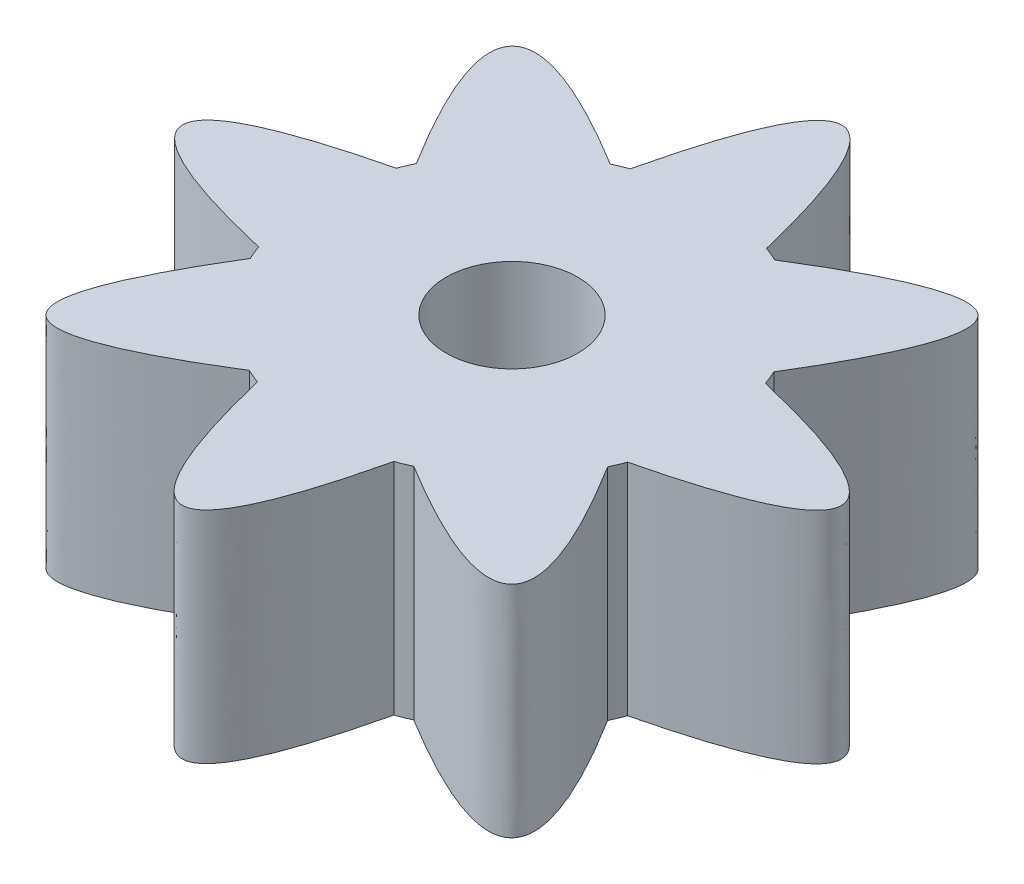
ISO-10303-21;
HEADER;
FILE_DESCRIPTION(('STEP AP214'),'2;1');
FILE_NAME('part.step','',(''),(''),'','','');
FILE_SCHEMA(('AUTOMOTIVE_DESIGN { 1 0 10303 214 1 1 1 1 }'));
ENDSEC;
DATA;
#1=APPLICATION_CONTEXT('core data for automotive mechanical design processes');
#2=APPLICATION_PROTOCOL_DEFINITION('international standard','automotive_design',2000,#1);
#3=PRODUCT_CONTEXT('',#1,'mechanical');
#4=PRODUCT('Part','Part','',(#3));
#5=PRODUCT_RELATED_PRODUCT_CATEGORY('part','',(#4));
#6=PRODUCT_DEFINITION_FORMATION('','',#4);
#7=PRODUCT_DEFINITION_CONTEXT('part definition',#1,'design');
#8=PRODUCT_DEFINITION('design','',#6,#7);
#9=PRODUCT_DEFINITION_SHAPE('','',#8);
#10=(LENGTH_UNIT() NAMED_UNIT(*) SI_UNIT(.MILLI.,.METRE.));
#11=(NAMED_UNIT(*) PLANE_ANGLE_UNIT() SI_UNIT($,.RADIAN.));
#12=(NAMED_UNIT(*) SI_UNIT($,.STERADIAN.) SOLID_ANGLE_UNIT());
#13=UNCERTAINTY_MEASURE_WITH_UNIT(LENGTH_MEASURE(1.E-05),#10,'distance_accuracy_value','');
#14=(GEOMETRIC_REPRESENTATION_CONTEXT(3) GLOBAL_UNCERTAINTY_ASSIGNED_CONTEXT((#13)) GLOBAL_UNIT_ASSIGNED_CONTEXT((#10,
#11,#12)) REPRESENTATION_CONTEXT('',''));
#15=CARTESIAN_POINT('',(0.,0.,0.));
#16=DIRECTION('',(0.,0.,1.));
#17=DIRECTION('',(1.,0.,0.));
#18=AXIS2_PLACEMENT_3D('',#15,#16,#17);
#19=CARTESIAN_POINT('',(-6.,2.5,42.5));
#20=DIRECTION('',(0.,-1.,0.));
#21=DIRECTION('',(0.,0.,-1.));
#22=AXIS2_PLACEMENT_3D('',#19,#20,#21);
#23=CYLINDRICAL_SURFACE('',#22,4.5);
#24=CARTESIAN_POINT('',(-6.,2.5,42.5));
#25=DIRECTION('',(0.,1.,0.));
#26=DIRECTION('',(0.,0.,1.));
#27=AXIS2_PLACEMENT_3D('',#24,#25,#26);
#28=CIRCLE('',#27,4.5);
#29=CARTESIAN_POINT('',(-7.90144374892193,2.5,46.5785428365638));
#30=VERTEX_POINT('',#29);
#31=CARTESIAN_POINT('',(-7.58091960966795,2.5,46.7131571520378));
#32=VERTEX_POINT('',#31);
#33=EDGE_CURVE('E45',#30,#32,#28,.T.);
#34=ORIENTED_EDGE('',*,*,#33,.F.);
#35=DIRECTION('',(0.,-1.,0.));
#36=VECTOR('',#35,1.);
#37=CARTESIAN_POINT('',(-7.90144374892191,2.5,46.5785428365638));
#38=LINE('',#37,#36);
#39=CARTESIAN_POINT('',(-7.90144374892191,-2.5,46.5785428365638));
#40=VERTEX_POINT('',#39);
#41=EDGE_CURVE('E159',#30,#40,#38,.T.);
#42=ORIENTED_EDGE('',*,*,#41,.T.);
#43=CARTESIAN_POINT('',(-6.,-2.5,42.5));
#44=DIRECTION('',(0.,1.,0.));
#45=DIRECTION('',(0.,0.,1.));
#46=AXIS2_PLACEMENT_3D('',#43,#44,#45);
#47=CIRCLE('',#46,4.5);
#48=CARTESIAN_POINT('',(-7.58091960966795,-2.5,46.7131571520378));
#49=VERTEX_POINT('',#48);
#50=EDGE_CURVE('E150',#40,#49,#47,.T.);
#51=ORIENTED_EDGE('',*,*,#50,.T.);
#52=DIRECTION('',(0.,-1.,0.));
#53=VECTOR('',#52,1.);
#54=CARTESIAN_POINT('',(-7.58091960966793,2.5,46.7131571520378));
#55=LINE('',#54,#53);
#56=EDGE_CURVE('E338',#32,#49,#55,.T.);
#57=ORIENTED_EDGE('',*,*,#56,.F.);
#58=EDGE_LOOP('',(#34,#42,#51,#57));
#59=FACE_BOUND('',#58,.T.);
#60=ADVANCED_FACE('F35',(#59),#23,.T.);
#61=CARTESIAN_POINT('',(-10.2284890660015,-2.5,44.0394415281866));
#62=VERTEX_POINT('',#61);
#63=CARTESIAN_POINT('',(-10.0970309689175,-2.5,44.3612730159036));
#64=VERTEX_POINT('',#63);
#65=EDGE_CURVE('E157',#62,#64,#47,.T.);
#66=ORIENTED_EDGE('',*,*,#65,.T.);
#67=DIRECTION('',(0.,-1.,0.));
#68=VECTOR('',#67,1.);
#69=CARTESIAN_POINT('',(-10.0970309689175,2.5,44.3612730159036));
#70=LINE('',#69,#68);
#71=CARTESIAN_POINT('',(-10.0970309689175,2.5,44.3612730159036));
#72=VERTEX_POINT('',#71);
#73=EDGE_CURVE('E59',#72,#64,#70,.T.);
#74=ORIENTED_EDGE('',*,*,#73,.F.);
#75=CARTESIAN_POINT('',(-10.2284890660015,2.5,44.0394415281866));
#76=VERTEX_POINT('',#75);
#77=EDGE_CURVE('E385',#76,#72,#28,.T.);
#78=ORIENTED_EDGE('',*,*,#77,.F.);
#79=DIRECTION('',(0.,-1.,0.));
#80=VECTOR('',#79,1.);
#81=CARTESIAN_POINT('',(-10.2284890660015,2.5,44.0394415281866));
#82=LINE('',#81,#80);
#83=EDGE_CURVE('E228',#76,#62,#82,.T.);
#84=ORIENTED_EDGE('',*,*,#83,.T.);
#85=EDGE_LOOP('',(#66,#74,#78,#84));
#86=FACE_BOUND('',#85,.T.);
#87=ADVANCED_FACE('F358',(#86),#23,.T.);
#88=CARTESIAN_POINT('',(-10.0785428365638,-2.5,40.5985562510781));
#89=VERTEX_POINT('',#88);
#90=CARTESIAN_POINT('',(-10.2131571520378,-2.5,40.9190803903321));
#91=VERTEX_POINT('',#90);
#92=EDGE_CURVE('E414',#89,#91,#47,.T.);
#93=ORIENTED_EDGE('',*,*,#92,.T.);
#94=DIRECTION('',(0.,-1.,0.));
#95=VECTOR('',#94,1.);
#96=CARTESIAN_POINT('',(-10.2131571520378,2.5,40.9190803903321));
#97=LINE('',#96,#95);
#98=CARTESIAN_POINT('',(-10.2131571520378,2.5,40.9190803903321));
#99=VERTEX_POINT('',#98);
#100=EDGE_CURVE('E190',#99,#91,#97,.T.);
#101=ORIENTED_EDGE('',*,*,#100,.F.);
#102=CARTESIAN_POINT('',(-10.0785428365638,2.5,40.5985562510781));
#103=VERTEX_POINT('',#102);
#104=EDGE_CURVE('E386',#103,#99,#28,.T.);
#105=ORIENTED_EDGE('',*,*,#104,.F.);
#106=DIRECTION('',(0.,-1.,0.));
#107=VECTOR('',#106,1.);
#108=CARTESIAN_POINT('',(-10.0785428365638,2.5,40.5985562510781));
#109=LINE('',#108,#107);
#110=EDGE_CURVE('E229',#103,#89,#109,.T.);
#111=ORIENTED_EDGE('',*,*,#110,.T.);
#112=EDGE_LOOP('',(#93,#101,#105,#111));
#113=FACE_BOUND('',#112,.T.);
#114=ADVANCED_FACE('F362',(#113),#23,.T.);
#115=CARTESIAN_POINT('',(-7.53944152818656,-2.5,38.2715109339985));
#116=VERTEX_POINT('',#115);
#117=CARTESIAN_POINT('',(-7.86127301590357,-2.5,38.4029690310825));
#118=VERTEX_POINT('',#117);
#119=EDGE_CURVE('E411',#116,#118,#47,.T.);
#120=ORIENTED_EDGE('',*,*,#119,.T.);
#121=DIRECTION('',(0.,-1.,0.));
#122=VECTOR('',#121,1.);
#123=CARTESIAN_POINT('',(-7.86127301590359,2.5,38.4029690310825));
#124=LINE('',#123,#122);
#125=CARTESIAN_POINT('',(-7.86127301590357,2.5,38.4029690310825));
#126=VERTEX_POINT('',#125);
#127=EDGE_CURVE('E219',#126,#118,#124,.T.);
#128=ORIENTED_EDGE('',*,*,#127,.F.);
#129=CARTESIAN_POINT('',(-7.53944152818656,2.5,38.2715109339985));
#130=VERTEX_POINT('',#129);
#131=EDGE_CURVE('E389',#130,#126,#28,.T.);
#132=ORIENTED_EDGE('',*,*,#131,.F.);
#133=DIRECTION('',(0.,-1.,0.));
#134=VECTOR('',#133,1.);
#135=CARTESIAN_POINT('',(-7.53944152818656,2.5,38.2715109339985));
#136=LINE('',#135,#134);
#137=EDGE_CURVE('E251',#130,#116,#136,.T.);
#138=ORIENTED_EDGE('',*,*,#137,.T.);
#139=EDGE_LOOP('',(#120,#128,#132,#138));
#140=FACE_BOUND('',#139,.T.);
#141=ADVANCED_FACE('F415',(#140),#23,.T.);
#142=CARTESIAN_POINT('',(-4.09855625107805,-2.5,38.4214571634362));
#143=VERTEX_POINT('',#142);
#144=CARTESIAN_POINT('',(-4.41908039033205,-2.5,38.2868428479622));
#145=VERTEX_POINT('',#144);
#146=EDGE_CURVE('E407',#143,#145,#47,.T.);
#147=ORIENTED_EDGE('',*,*,#146,.T.);
#148=DIRECTION('',(0.,-1.,0.));
#149=VECTOR('',#148,1.);
#150=CARTESIAN_POINT('',(-4.41908039033207,2.5,38.2868428479622));
#151=LINE('',#150,#149);
#152=CARTESIAN_POINT('',(-4.41908039033205,2.5,38.2868428479622));
#153=VERTEX_POINT('',#152);
#154=EDGE_CURVE('E243',#153,#145,#151,.T.);
#155=ORIENTED_EDGE('',*,*,#154,.F.);
#156=CARTESIAN_POINT('',(-4.09855625107803,2.5,38.4214571634362));
#157=VERTEX_POINT('',#156);
#158=EDGE_CURVE('E392',#157,#153,#28,.T.);
#159=ORIENTED_EDGE('',*,*,#158,.F.);
#160=DIRECTION('',(0.,-1.,0.));
#161=VECTOR('',#160,1.);
#162=CARTESIAN_POINT('',(-4.09855625107805,2.5,38.4214571634362));
#163=LINE('',#162,#161);
#164=EDGE_CURVE('E301',#157,#143,#163,.T.);
#165=ORIENTED_EDGE('',*,*,#164,.T.);
#166=EDGE_LOOP('',(#147,#155,#159,#165));
#167=FACE_BOUND('',#166,.T.);
#168=ADVANCED_FACE('F406',(#167),#23,.T.);
#169=CARTESIAN_POINT('',(-1.77151093399846,-2.5,40.9605584718134));
#170=VERTEX_POINT('',#169);
#171=CARTESIAN_POINT('',(-1.90296903108249,-2.5,40.6387269840964));
#172=VERTEX_POINT('',#171);
#173=EDGE_CURVE('E379',#170,#172,#47,.T.);
#174=ORIENTED_EDGE('',*,*,#173,.T.);
#175=DIRECTION('',(0.,-1.,0.));
#176=VECTOR('',#175,1.);
#177=CARTESIAN_POINT('',(-1.90296903108248,2.5,40.6387269840964));
#178=LINE('',#177,#176);
#179=CARTESIAN_POINT('',(-1.90296903108249,2.5,40.6387269840964));
#180=VERTEX_POINT('',#179);
#181=EDGE_CURVE('E266',#180,#172,#178,.T.);
#182=ORIENTED_EDGE('',*,*,#181,.F.);
#183=CARTESIAN_POINT('',(-1.77151093399846,2.5,40.9605584718134));
#184=VERTEX_POINT('',#183);
#185=EDGE_CURVE('E395',#184,#180,#28,.T.);
#186=ORIENTED_EDGE('',*,*,#185,.F.);
#187=DIRECTION('',(0.,-1.,0.));
#188=VECTOR('',#187,1.);
#189=CARTESIAN_POINT('',(-1.77151093399846,2.5,40.9605584718134));
#190=LINE('',#189,#188);
#191=EDGE_CURVE('E302',#184,#170,#190,.T.);
#192=ORIENTED_EDGE('',*,*,#191,.T.);
#193=EDGE_LOOP('',(#174,#182,#186,#192));
#194=FACE_BOUND('',#193,.T.);
#195=ADVANCED_FACE('F369',(#194),#23,.T.);
#196=CARTESIAN_POINT('',(-1.92145716343623,-2.5,44.401443748922));
#197=VERTEX_POINT('',#196);
#198=CARTESIAN_POINT('',(-1.78684284796218,-2.5,44.0809196096679));
#199=VERTEX_POINT('',#198);
#200=EDGE_CURVE('E373',#197,#199,#47,.T.);
#201=ORIENTED_EDGE('',*,*,#200,.T.);
#202=DIRECTION('',(0.,-1.,0.));
#203=VECTOR('',#202,1.);
#204=CARTESIAN_POINT('',(-1.78684284796218,2.5,44.0809196096679));
#205=LINE('',#204,#203);
#206=CARTESIAN_POINT('',(-1.78684284796218,2.5,44.0809196096679));
#207=VERTEX_POINT('',#206);
#208=EDGE_CURVE('E292',#207,#199,#205,.T.);
#209=ORIENTED_EDGE('',*,*,#208,.F.);
#210=CARTESIAN_POINT('',(-1.92145716343624,2.5,44.401443748922));
#211=VERTEX_POINT('',#210);
#212=EDGE_CURVE('E44',#211,#207,#28,.T.);
#213=ORIENTED_EDGE('',*,*,#212,.F.);
#214=DIRECTION('',(0.,-1.,0.));
#215=VECTOR('',#214,1.);
#216=CARTESIAN_POINT('',(-1.92145716343623,2.5,44.401443748922));
#217=LINE('',#216,#215);
#218=EDGE_CURVE('E324',#211,#197,#217,.T.);
#219=ORIENTED_EDGE('',*,*,#218,.T.);
#220=EDGE_LOOP('',(#201,#209,#213,#219));
#221=FACE_BOUND('',#220,.T.);
#222=ADVANCED_FACE('F364',(#221),#23,.T.);
#223=CARTESIAN_POINT('',(-4.46055847181344,-2.5,46.7284890660016));
#224=VERTEX_POINT('',#223);
#225=CARTESIAN_POINT('',(-4.13872698409646,-2.5,46.5970309689175));
#226=VERTEX_POINT('',#225);
#227=EDGE_CURVE('E39',#224,#226,#47,.T.);
#228=ORIENTED_EDGE('',*,*,#227,.T.);
#229=DIRECTION('',(0.,-1.,0.));
#230=VECTOR('',#229,1.);
#231=CARTESIAN_POINT('',(-4.13872698409645,2.5,46.5970309689175));
#232=LINE('',#231,#230);
#233=CARTESIAN_POINT('',(-4.13872698409646,2.5,46.5970309689175));
#234=VERTEX_POINT('',#233);
#235=EDGE_CURVE('E316',#234,#226,#232,.T.);
#236=ORIENTED_EDGE('',*,*,#235,.F.);
#237=CARTESIAN_POINT('',(-4.46055847181344,2.5,46.7284890660016));
#238=VERTEX_POINT('',#237);
#239=EDGE_CURVE('E11',#238,#234,#28,.T.);
#240=ORIENTED_EDGE('',*,*,#239,.F.);
#241=DIRECTION('',(0.,-1.,0.));
#242=VECTOR('',#241,1.);
#243=CARTESIAN_POINT('',(-4.46055847181344,2.5,46.7284890660016));
#244=LINE('',#243,#242);
#245=EDGE_CURVE('E158',#238,#224,#244,.T.);
#246=ORIENTED_EDGE('',*,*,#245,.T.);
#247=EDGE_LOOP('',(#228,#236,#240,#246));
#248=FACE_BOUND('',#247,.T.);
#249=ADVANCED_FACE('F37',(#248),#23,.T.);
#250=CARTESIAN_POINT('',(-6.,2.5,42.5));
#251=DIRECTION('',(0.,1.,0.));
#252=DIRECTION('',(0.,0.,1.));
#253=AXIS2_PLACEMENT_3D('',#250,#251,#252);
#254=PLANE('',#253);
#255=CARTESIAN_POINT('',(-6.,2.5,42.5));
#256=DIRECTION('',(0.,-1.,0.));
#257=DIRECTION('',(0.,0.,-1.));
#258=AXIS2_PLACEMENT_3D('',#255,#256,#257);
#259=CIRCLE('',#258,1.5);
#260=CARTESIAN_POINT('',(-6.,2.5,41.));
#261=VERTEX_POINT('',#260);
#262=EDGE_CURVE('E167',#261,#261,#259,.T.);
#263=ORIENTED_EDGE('',*,*,#262,.T.);
#264=EDGE_LOOP('',(#263));
#265=FACE_BOUND('',#264,.T.);
#266=ORIENTED_EDGE('',*,*,#77,.T.);
#267=CARTESIAN_POINT('',(-7.9014437489219,2.5,46.5785428365638));
#268=CARTESIAN_POINT('',(-13.6170244948079,2.5,50.1271154226686));
#269=CARTESIAN_POINT('',(-10.0970309689175,2.5,44.3612730159036));
#270=B_SPLINE_CURVE_WITH_KNOTS('',2,(#267,#268,#269),.UNSPECIFIED.,.F.,.F.,(3,3),(0.,1.),.UNSPECIFIED.);
#271=EDGE_CURVE('E166',#30,#72,#270,.T.);
#272=ORIENTED_EDGE('',*,*,#271,.F.);
#273=ORIENTED_EDGE('',*,*,#33,.T.);
#274=CARTESIAN_POINT('',(-4.46055847181344,2.5,46.7284890660015));
#275=CARTESIAN_POINT('',(-5.99286463648132,2.5,53.2792347090042));
#276=CARTESIAN_POINT('',(-7.58091960966794,2.5,46.7131571520378));
#277=B_SPLINE_CURVE_WITH_KNOTS('',2,(#274,#275,#276),.UNSPECIFIED.,.F.,.F.,(3,3),(0.,1.),.UNSPECIFIED.);
#278=EDGE_CURVE('E332',#238,#32,#277,.T.);
#279=ORIENTED_EDGE('',*,*,#278,.F.);
#280=ORIENTED_EDGE('',*,*,#239,.T.);
#281=CARTESIAN_POINT('',(-1.92145716343625,2.5,44.4014437489219));
#282=CARTESIAN_POINT('',(1.62711542266855,2.5,50.117024494808));
#283=CARTESIAN_POINT('',(-4.13872698409645,2.5,46.5970309689175));
#284=B_SPLINE_CURVE_WITH_KNOTS('',2,(#281,#282,#283),.UNSPECIFIED.,.F.,.F.,(3,3),(0.,1.),.UNSPECIFIED.);
#285=EDGE_CURVE('E310',#211,#234,#284,.T.);
#286=ORIENTED_EDGE('',*,*,#285,.F.);
#287=ORIENTED_EDGE('',*,*,#212,.T.);
#288=CARTESIAN_POINT('',(-1.77151093399847,2.5,40.9605584718134));
#289=CARTESIAN_POINT('',(4.77923470900418,2.5,42.4928646364813));
#290=CARTESIAN_POINT('',(-1.78684284796218,2.5,44.0809196096679));
#291=B_SPLINE_CURVE_WITH_KNOTS('',2,(#288,#289,#290),.UNSPECIFIED.,.F.,.F.,(3,3),(0.,1.),.UNSPECIFIED.);
#292=EDGE_CURVE('E285',#184,#207,#291,.T.);
#293=ORIENTED_EDGE('',*,*,#292,.F.);
#294=ORIENTED_EDGE('',*,*,#185,.T.);
#295=CARTESIAN_POINT('',(-4.09855625107806,2.5,38.4214571634362));
#296=CARTESIAN_POINT('',(1.61702449480793,2.5,34.8728845773314));
#297=CARTESIAN_POINT('',(-1.90296903108248,2.5,40.6387269840964));
#298=B_SPLINE_CURVE_WITH_KNOTS('',2,(#295,#296,#297),.UNSPECIFIED.,.F.,.F.,(3,3),(0.,1.),.UNSPECIFIED.);
#299=EDGE_CURVE('E260',#157,#180,#298,.T.);
#300=ORIENTED_EDGE('',*,*,#299,.F.);
#301=ORIENTED_EDGE('',*,*,#158,.T.);
#302=CARTESIAN_POINT('',(-7.53944152818656,2.5,38.2715109339985));
#303=CARTESIAN_POINT('',(-6.00713536351868,2.5,31.7207652909958));
#304=CARTESIAN_POINT('',(-4.41908039033206,2.5,38.2868428479622));
#305=B_SPLINE_CURVE_WITH_KNOTS('',2,(#302,#303,#304),.UNSPECIFIED.,.F.,.F.,(3,3),(0.,1.),.UNSPECIFIED.);
#306=EDGE_CURVE('E237',#130,#153,#305,.T.);
#307=ORIENTED_EDGE('',*,*,#306,.F.);
#308=ORIENTED_EDGE('',*,*,#131,.T.);
#309=CARTESIAN_POINT('',(-10.0785428365638,2.5,40.5985562510781));
#310=CARTESIAN_POINT('',(-13.6271154226686,2.5,34.8829755051921));
#311=CARTESIAN_POINT('',(-7.86127301590359,2.5,38.4029690310825));
#312=B_SPLINE_CURVE_WITH_KNOTS('',2,(#309,#310,#311),.UNSPECIFIED.,.F.,.F.,(3,3),(0.,1.),.UNSPECIFIED.);
#313=EDGE_CURVE('E212',#103,#126,#312,.T.);
#314=ORIENTED_EDGE('',*,*,#313,.F.);
#315=ORIENTED_EDGE('',*,*,#104,.T.);
#316=CARTESIAN_POINT('',(-10.2284890660015,2.5,44.0394415281866));
#317=CARTESIAN_POINT('',(-16.7792347090042,2.5,42.5071353635188));
#318=CARTESIAN_POINT('',(-10.2131571520378,2.5,40.9190803903321));
#319=B_SPLINE_CURVE_WITH_KNOTS('',2,(#316,#317,#318),.UNSPECIFIED.,.F.,.F.,(3,3),(0.,1.),.UNSPECIFIED.);
#320=EDGE_CURVE('E184',#76,#99,#319,.T.);
#321=ORIENTED_EDGE('',*,*,#320,.F.);
#322=EDGE_LOOP('',(#266,#272,#273,#279,#280,#286,#287,#293,#294,#300,#301,#307,#308,#314,#315,#321));
#323=FACE_BOUND('',#322,.T.);
#324=ADVANCED_FACE('F349',(#265,#323),#254,.T.);
#325=CARTESIAN_POINT('',(-6.,-2.5,42.5));
#326=DIRECTION('',(0.,1.,0.));
#327=DIRECTION('',(0.,0.,1.));
#328=AXIS2_PLACEMENT_3D('',#325,#326,#327);
#329=PLANE('',#328);
#330=CARTESIAN_POINT('',(-6.,-2.5,42.5));
#331=DIRECTION('',(0.,-1.,0.));
#332=DIRECTION('',(0.,0.,-1.));
#333=AXIS2_PLACEMENT_3D('',#330,#331,#332);
#334=CIRCLE('',#333,1.5);
#335=CARTESIAN_POINT('',(-6.,-2.5,41.));
#336=VERTEX_POINT('',#335);
#337=EDGE_CURVE('E171',#336,#336,#334,.T.);
#338=ORIENTED_EDGE('',*,*,#337,.F.);
#339=EDGE_LOOP('',(#338));
#340=FACE_BOUND('',#339,.T.);
#341=ORIENTED_EDGE('',*,*,#50,.F.);
#342=CARTESIAN_POINT('',(-7.9014437489219,-2.5,46.5785428365638));
#343=CARTESIAN_POINT('',(-13.6170244948079,-2.5,50.1271154226686));
#344=CARTESIAN_POINT('',(-10.0970309689175,-2.5,44.3612730159036));
#345=B_SPLINE_CURVE_WITH_KNOTS('',2,(#342,#343,#344),.UNSPECIFIED.,.F.,.F.,(3,3),(0.,1.),.UNSPECIFIED.);
#346=EDGE_CURVE('E153',#40,#64,#345,.T.);
#347=ORIENTED_EDGE('',*,*,#346,.T.);
#348=ORIENTED_EDGE('',*,*,#65,.F.);
#349=CARTESIAN_POINT('',(-10.2284890660015,-2.5,44.0394415281866));
#350=CARTESIAN_POINT('',(-16.7792347090042,-2.5,42.5071353635188));
#351=CARTESIAN_POINT('',(-10.2131571520378,-2.5,40.9190803903321));
#352=B_SPLINE_CURVE_WITH_KNOTS('',2,(#349,#350,#351),.UNSPECIFIED.,.F.,.F.,(3,3),(0.,1.),.UNSPECIFIED.);
#353=EDGE_CURVE('E163',#62,#91,#352,.T.);
#354=ORIENTED_EDGE('',*,*,#353,.T.);
#355=ORIENTED_EDGE('',*,*,#92,.F.);
#356=CARTESIAN_POINT('',(-10.0785428365638,-2.5,40.5985562510781));
#357=CARTESIAN_POINT('',(-13.6271154226686,-2.5,34.8829755051921));
#358=CARTESIAN_POINT('',(-7.86127301590359,-2.5,38.4029690310825));
#359=B_SPLINE_CURVE_WITH_KNOTS('',2,(#356,#357,#358),.UNSPECIFIED.,.F.,.F.,(3,3),(0.,1.),.UNSPECIFIED.);
#360=EDGE_CURVE('E220',#89,#118,#359,.T.);
#361=ORIENTED_EDGE('',*,*,#360,.T.);
#362=ORIENTED_EDGE('',*,*,#119,.F.);
#363=CARTESIAN_POINT('',(-7.53944152818656,-2.5,38.2715109339985));
#364=CARTESIAN_POINT('',(-6.00713536351868,-2.5,31.7207652909958));
#365=CARTESIAN_POINT('',(-4.41908039033206,-2.5,38.2868428479622));
#366=B_SPLINE_CURVE_WITH_KNOTS('',2,(#363,#364,#365),.UNSPECIFIED.,.F.,.F.,(3,3),(0.,1.),.UNSPECIFIED.);
#367=EDGE_CURVE('E235',#116,#145,#366,.T.);
#368=ORIENTED_EDGE('',*,*,#367,.T.);
#369=ORIENTED_EDGE('',*,*,#146,.F.);
#370=CARTESIAN_POINT('',(-4.09855625107806,-2.5,38.4214571634362));
#371=CARTESIAN_POINT('',(1.61702449480793,-2.5,34.8728845773314));
#372=CARTESIAN_POINT('',(-1.90296903108248,-2.5,40.6387269840964));
#373=B_SPLINE_CURVE_WITH_KNOTS('',2,(#370,#371,#372),.UNSPECIFIED.,.F.,.F.,(3,3),(0.,1.),.UNSPECIFIED.);
#374=EDGE_CURVE('E257',#143,#172,#373,.T.);
#375=ORIENTED_EDGE('',*,*,#374,.T.);
#376=ORIENTED_EDGE('',*,*,#173,.F.);
#377=CARTESIAN_POINT('',(-1.77151093399847,-2.5,40.9605584718134));
#378=CARTESIAN_POINT('',(4.77923470900418,-2.5,42.4928646364813));
#379=CARTESIAN_POINT('',(-1.78684284796218,-2.5,44.0809196096679));
#380=B_SPLINE_CURVE_WITH_KNOTS('',2,(#377,#378,#379),.UNSPECIFIED.,.F.,.F.,(3,3),(0.,1.),.UNSPECIFIED.);
#381=EDGE_CURVE('E293',#170,#199,#380,.T.);
#382=ORIENTED_EDGE('',*,*,#381,.T.);
#383=ORIENTED_EDGE('',*,*,#200,.F.);
#384=CARTESIAN_POINT('',(-1.92145716343625,-2.5,44.4014437489219));
#385=CARTESIAN_POINT('',(1.62711542266855,-2.5,50.117024494808));
#386=CARTESIAN_POINT('',(-4.13872698409645,-2.5,46.5970309689175));
#387=B_SPLINE_CURVE_WITH_KNOTS('',2,(#384,#385,#386),.UNSPECIFIED.,.F.,.F.,(3,3),(0.,1.),.UNSPECIFIED.);
#388=EDGE_CURVE('E308',#197,#226,#387,.T.);
#389=ORIENTED_EDGE('',*,*,#388,.T.);
#390=ORIENTED_EDGE('',*,*,#227,.F.);
#391=CARTESIAN_POINT('',(-4.46055847181344,-2.5,46.7284890660015));
#392=CARTESIAN_POINT('',(-5.99286463648132,-2.5,53.2792347090042));
#393=CARTESIAN_POINT('',(-7.58091960966794,-2.5,46.7131571520378));
#394=B_SPLINE_CURVE_WITH_KNOTS('',2,(#391,#392,#393),.UNSPECIFIED.,.F.,.F.,(3,3),(0.,1.),.UNSPECIFIED.);
#395=EDGE_CURVE('E155',#224,#49,#394,.T.);
#396=ORIENTED_EDGE('',*,*,#395,.T.);
#397=EDGE_LOOP('',(#341,#347,#348,#354,#355,#361,#362,#368,#369,#375,#376,#382,#383,#389,#390,#396));
#398=FACE_BOUND('',#397,.T.);
#399=ADVANCED_FACE('F151',(#340,#398),#329,.F.);
#400=DIRECTION('',(0.,-1.,0.));
#401=VECTOR('',#400,1.);
#402=SURFACE_OF_LINEAR_EXTRUSION('',#277,#401);
#403=ORIENTED_EDGE('',*,*,#395,.F.);
#404=ORIENTED_EDGE('',*,*,#245,.F.);
#405=ORIENTED_EDGE('',*,*,#278,.T.);
#406=ORIENTED_EDGE('',*,*,#56,.T.);
#407=EDGE_LOOP('',(#403,#404,#405,#406));
#408=FACE_BOUND('',#407,.T.);
#409=ADVANCED_FACE('F345',(#408),#402,.T.);
#410=DIRECTION('',(0.,-1.,0.));
#411=VECTOR('',#410,1.);
#412=SURFACE_OF_LINEAR_EXTRUSION('',#284,#411);
#413=ORIENTED_EDGE('',*,*,#388,.F.);
#414=ORIENTED_EDGE('',*,*,#218,.F.);
#415=ORIENTED_EDGE('',*,*,#285,.T.);
#416=ORIENTED_EDGE('',*,*,#235,.T.);
#417=EDGE_LOOP('',(#413,#414,#415,#416));
#418=FACE_BOUND('',#417,.T.);
#419=ADVANCED_FACE('F281',(#418),#412,.T.);
#420=DIRECTION('',(0.,-1.,0.));
#421=VECTOR('',#420,1.);
#422=SURFACE_OF_LINEAR_EXTRUSION('',#291,#421);
#423=ORIENTED_EDGE('',*,*,#381,.F.);
#424=ORIENTED_EDGE('',*,*,#191,.F.);
#425=ORIENTED_EDGE('',*,*,#292,.T.);
#426=ORIENTED_EDGE('',*,*,#208,.T.);
#427=EDGE_LOOP('',(#423,#424,#425,#426));
#428=FACE_BOUND('',#427,.T.);
#429=ADVANCED_FACE('F276',(#428),#422,.T.);
#430=DIRECTION('',(0.,-1.,0.));
#431=VECTOR('',#430,1.);
#432=SURFACE_OF_LINEAR_EXTRUSION('',#298,#431);
#433=ORIENTED_EDGE('',*,*,#374,.F.);
#434=ORIENTED_EDGE('',*,*,#164,.F.);
#435=ORIENTED_EDGE('',*,*,#299,.T.);
#436=ORIENTED_EDGE('',*,*,#181,.T.);
#437=EDGE_LOOP('',(#433,#434,#435,#436));
#438=FACE_BOUND('',#437,.T.);
#439=ADVANCED_FACE('F273',(#438),#432,.T.);
#440=DIRECTION('',(0.,-1.,0.));
#441=VECTOR('',#440,1.);
#442=SURFACE_OF_LINEAR_EXTRUSION('',#305,#441);
#443=ORIENTED_EDGE('',*,*,#367,.F.);
#444=ORIENTED_EDGE('',*,*,#137,.F.);
#445=ORIENTED_EDGE('',*,*,#306,.T.);
#446=ORIENTED_EDGE('',*,*,#154,.T.);
#447=EDGE_LOOP('',(#443,#444,#445,#446));
#448=FACE_BOUND('',#447,.T.);
#449=ADVANCED_FACE('F208',(#448),#442,.T.);
#450=DIRECTION('',(0.,-1.,0.));
#451=VECTOR('',#450,1.);
#452=SURFACE_OF_LINEAR_EXTRUSION('',#312,#451);
#453=ORIENTED_EDGE('',*,*,#360,.F.);
#454=ORIENTED_EDGE('',*,*,#110,.F.);
#455=ORIENTED_EDGE('',*,*,#313,.T.);
#456=ORIENTED_EDGE('',*,*,#127,.T.);
#457=EDGE_LOOP('',(#453,#454,#455,#456));
#458=FACE_BOUND('',#457,.T.);
#459=ADVANCED_FACE('F202',(#458),#452,.T.);
#460=DIRECTION('',(0.,-1.,0.));
#461=VECTOR('',#460,1.);
#462=SURFACE_OF_LINEAR_EXTRUSION('',#319,#461);
#463=ORIENTED_EDGE('',*,*,#353,.F.);
#464=ORIENTED_EDGE('',*,*,#83,.F.);
#465=ORIENTED_EDGE('',*,*,#320,.T.);
#466=ORIENTED_EDGE('',*,*,#100,.T.);
#467=EDGE_LOOP('',(#463,#464,#465,#466));
#468=FACE_BOUND('',#467,.T.);
#469=ADVANCED_FACE('F198',(#468),#462,.T.);
#470=DIRECTION('',(0.,-1.,0.));
#471=VECTOR('',#470,1.);
#472=SURFACE_OF_LINEAR_EXTRUSION('',#270,#471);
#473=ORIENTED_EDGE('',*,*,#346,.F.);
#474=ORIENTED_EDGE('',*,*,#41,.F.);
#475=ORIENTED_EDGE('',*,*,#271,.T.);
#476=ORIENTED_EDGE('',*,*,#73,.T.);
#477=EDGE_LOOP('',(#473,#474,#475,#476));
#478=FACE_BOUND('',#477,.T.);
#479=ADVANCED_FACE('F165',(#478),#472,.T.);
#480=CARTESIAN_POINT('',(-6.,2.5,42.5));
#481=DIRECTION('',(0.,-1.,0.));
#482=DIRECTION('',(0.,0.,-1.));
#483=AXIS2_PLACEMENT_3D('',#480,#481,#482);
#484=CYLINDRICAL_SURFACE('',#483,1.5);
#485=ORIENTED_EDGE('',*,*,#262,.F.);
#486=EDGE_LOOP('',(#485));
#487=FACE_BOUND('',#486,.T.);
#488=ORIENTED_EDGE('',*,*,#337,.T.);
#489=EDGE_LOOP('',(#488));
#490=FACE_BOUND('',#489,.T.);
#491=ADVANCED_FACE('F493',(#487,#490),#484,.F.);
#492=CLOSED_SHELL('',(#60,#87,#114,#141,#168,#195,#222,#249,#324,#399,#409,#419,#429,#439,#449,
#459,#469,#479,#491));
#493=MANIFOLD_SOLID_BREP('B2',#492);
#494=ADVANCED_BREP_SHAPE_REPRESENTATION('',(#18,#493),#14);
#495=SHAPE_DEFINITION_REPRESENTATION(#9,#494);
ENDSEC;
END-ISO-10303-21;
